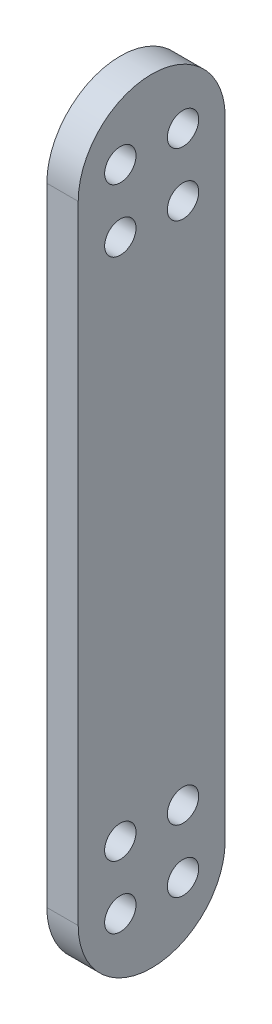
ISO-10303-21;
HEADER;
FILE_DESCRIPTION(('STEP AP214'),'2;1');
FILE_NAME('part.step','',(''),(''),'','','');
FILE_SCHEMA(('AUTOMOTIVE_DESIGN { 1 0 10303 214 1 1 1 1 }'));
ENDSEC;
DATA;
#1=APPLICATION_CONTEXT('core data for automotive mechanical design processes');
#2=APPLICATION_PROTOCOL_DEFINITION('international standard','automotive_design',2000,#1);
#3=PRODUCT_CONTEXT('',#1,'mechanical');
#4=PRODUCT('Part','Part','',(#3));
#5=PRODUCT_RELATED_PRODUCT_CATEGORY('part','',(#4));
#6=PRODUCT_DEFINITION_FORMATION('','',#4);
#7=PRODUCT_DEFINITION_CONTEXT('part definition',#1,'design');
#8=PRODUCT_DEFINITION('design','',#6,#7);
#9=PRODUCT_DEFINITION_SHAPE('','',#8);
#10=(LENGTH_UNIT() NAMED_UNIT(*) SI_UNIT(.MILLI.,.METRE.));
#11=(NAMED_UNIT(*) PLANE_ANGLE_UNIT() SI_UNIT($,.RADIAN.));
#12=(NAMED_UNIT(*) SI_UNIT($,.STERADIAN.) SOLID_ANGLE_UNIT());
#13=UNCERTAINTY_MEASURE_WITH_UNIT(LENGTH_MEASURE(1.E-05),#10,'distance_accuracy_value','');
#14=(GEOMETRIC_REPRESENTATION_CONTEXT(3) GLOBAL_UNCERTAINTY_ASSIGNED_CONTEXT((#13)) GLOBAL_UNIT_ASSIGNED_CONTEXT((#10,
#11,#12)) REPRESENTATION_CONTEXT('',''));
#15=CARTESIAN_POINT('',(0.,0.,0.));
#16=DIRECTION('',(0.,0.,1.));
#17=DIRECTION('',(1.,0.,0.));
#18=AXIS2_PLACEMENT_3D('',#15,#16,#17);
#19=CARTESIAN_POINT('',(0.,0.,0.));
#20=DIRECTION('',(-1.,0.,0.));
#21=DIRECTION('',(0.,0.,1.));
#22=AXIS2_PLACEMENT_3D('',#19,#20,#21);
#23=PLANE('',#22);
#24=CARTESIAN_POINT('',(0.,125.413224236194,25.));
#25=DIRECTION('',(-1.,0.,0.));
#26=DIRECTION('',(0.,0.,1.));
#27=AXIS2_PLACEMENT_3D('',#24,#25,#26);
#28=CIRCLE('',#27,2.5);
#29=CARTESIAN_POINT('',(0.,125.413224236194,27.5));
#30=VERTEX_POINT('',#29);
#31=EDGE_CURVE('E130',#30,#30,#28,.T.);
#32=ORIENTED_EDGE('',*,*,#31,.T.);
#33=EDGE_LOOP('',(#32));
#34=FACE_BOUND('',#33,.T.);
#35=CARTESIAN_POINT('',(0.,125.413224236194,15.));
#36=DIRECTION('',(-1.,0.,0.));
#37=DIRECTION('',(0.,0.,1.));
#38=AXIS2_PLACEMENT_3D('',#35,#36,#37);
#39=CIRCLE('',#38,2.5);
#40=CARTESIAN_POINT('',(0.,125.413224236194,17.5));
#41=VERTEX_POINT('',#40);
#42=EDGE_CURVE('E114',#41,#41,#39,.T.);
#43=ORIENTED_EDGE('',*,*,#42,.T.);
#44=EDGE_LOOP('',(#43));
#45=FACE_BOUND('',#44,.T.);
#46=CARTESIAN_POINT('',(0.,135.413224236194,25.));
#47=DIRECTION('',(-1.,0.,0.));
#48=DIRECTION('',(0.,0.,1.));
#49=AXIS2_PLACEMENT_3D('',#46,#47,#48);
#50=CIRCLE('',#49,2.5);
#51=CARTESIAN_POINT('',(0.,135.413224236194,27.5));
#52=VERTEX_POINT('',#51);
#53=EDGE_CURVE('E110',#52,#52,#50,.T.);
#54=ORIENTED_EDGE('',*,*,#53,.T.);
#55=EDGE_LOOP('',(#54));
#56=FACE_BOUND('',#55,.T.);
#57=CARTESIAN_POINT('',(0.,135.413224236194,15.));
#58=DIRECTION('',(-1.,0.,0.));
#59=DIRECTION('',(0.,0.,1.));
#60=AXIS2_PLACEMENT_3D('',#57,#58,#59);
#61=CIRCLE('',#60,2.5);
#62=CARTESIAN_POINT('',(0.,135.413224236194,17.5));
#63=VERTEX_POINT('',#62);
#64=EDGE_CURVE('E107',#63,#63,#61,.T.);
#65=ORIENTED_EDGE('',*,*,#64,.T.);
#66=EDGE_LOOP('',(#65));
#67=FACE_BOUND('',#66,.T.);
#68=CARTESIAN_POINT('',(0.,133.697961809387,20.));
#69=DIRECTION('',(-1.,0.,0.));
#70=DIRECTION('',(0.,0.,1.));
#71=AXIS2_PLACEMENT_3D('',#68,#69,#70);
#72=CIRCLE('',#71,11.715262426807);
#73=CARTESIAN_POINT('',(0.,133.697961809387,31.715262426807));
#74=VERTEX_POINT('',#73);
#75=CARTESIAN_POINT('',(0.,133.697961809387,8.28473757319303));
#76=VERTEX_POINT('',#75);
#77=EDGE_CURVE('E126',#74,#76,#72,.T.);
#78=ORIENTED_EDGE('',*,*,#77,.F.);
#79=DIRECTION('',(0.,-1.,0.));
#80=VECTOR('',#79,1.);
#81=CARTESIAN_POINT('',(0.,0.,31.715262426807));
#82=LINE('',#81,#80);
#83=CARTESIAN_POINT('',(0.,33.6979618093871,31.715262426807));
#84=VERTEX_POINT('',#83);
#85=EDGE_CURVE('E46',#74,#84,#82,.T.);
#86=ORIENTED_EDGE('',*,*,#85,.T.);
#87=CARTESIAN_POINT('',(0.,33.6979618093871,20.));
#88=DIRECTION('',(-1.,0.,0.));
#89=DIRECTION('',(0.,0.,1.));
#90=AXIS2_PLACEMENT_3D('',#87,#88,#89);
#91=CIRCLE('',#90,11.715262426807);
#92=CARTESIAN_POINT('',(0.,33.6979618093871,8.28473757319303));
#93=VERTEX_POINT('',#92);
#94=EDGE_CURVE('E75',#93,#84,#91,.T.);
#95=ORIENTED_EDGE('',*,*,#94,.F.);
#96=DIRECTION('',(0.,1.,0.));
#97=VECTOR('',#96,1.);
#98=CARTESIAN_POINT('',(0.,0.,8.28473757319303));
#99=LINE('',#98,#97);
#100=EDGE_CURVE('E120',#93,#76,#99,.T.);
#101=ORIENTED_EDGE('',*,*,#100,.T.);
#102=EDGE_LOOP('',(#78,#86,#95,#101));
#103=FACE_BOUND('',#102,.T.);
#104=CARTESIAN_POINT('',(0.,31.9826993825801,25.));
#105=DIRECTION('',(-1.,0.,0.));
#106=DIRECTION('',(0.,0.,1.));
#107=AXIS2_PLACEMENT_3D('',#104,#105,#106);
#108=CIRCLE('',#107,2.5);
#109=CARTESIAN_POINT('',(0.,31.9826993825801,27.5));
#110=VERTEX_POINT('',#109);
#111=EDGE_CURVE('E11',#110,#110,#108,.F.);
#112=ORIENTED_EDGE('',*,*,#111,.F.);
#113=EDGE_LOOP('',(#112));
#114=FACE_BOUND('',#113,.T.);
#115=CARTESIAN_POINT('',(0.,31.9826993825801,15.));
#116=DIRECTION('',(-1.,0.,0.));
#117=DIRECTION('',(0.,0.,1.));
#118=AXIS2_PLACEMENT_3D('',#115,#116,#117);
#119=CIRCLE('',#118,2.5);
#120=CARTESIAN_POINT('',(0.,31.9826993825801,17.5));
#121=VERTEX_POINT('',#120);
#122=EDGE_CURVE('E116',#121,#121,#119,.F.);
#123=ORIENTED_EDGE('',*,*,#122,.F.);
#124=EDGE_LOOP('',(#123));
#125=FACE_BOUND('',#124,.T.);
#126=CARTESIAN_POINT('',(0.,41.9826993825801,25.));
#127=DIRECTION('',(-1.,0.,0.));
#128=DIRECTION('',(0.,0.,1.));
#129=AXIS2_PLACEMENT_3D('',#126,#127,#128);
#130=CIRCLE('',#129,2.5);
#131=CARTESIAN_POINT('',(0.,41.9826993825801,27.5));
#132=VERTEX_POINT('',#131);
#133=EDGE_CURVE('E121',#132,#132,#130,.F.);
#134=ORIENTED_EDGE('',*,*,#133,.F.);
#135=EDGE_LOOP('',(#134));
#136=FACE_BOUND('',#135,.T.);
#137=CARTESIAN_POINT('',(0.,41.9826993825801,15.));
#138=DIRECTION('',(-1.,0.,0.));
#139=DIRECTION('',(0.,0.,1.));
#140=AXIS2_PLACEMENT_3D('',#137,#138,#139);
#141=CIRCLE('',#140,2.5);
#142=CARTESIAN_POINT('',(0.,41.9826993825801,17.5));
#143=VERTEX_POINT('',#142);
#144=EDGE_CURVE('E111',#143,#143,#141,.F.);
#145=ORIENTED_EDGE('',*,*,#144,.F.);
#146=EDGE_LOOP('',(#145));
#147=FACE_BOUND('',#146,.T.);
#148=ADVANCED_FACE('F36',(#34,#45,#56,#67,#103,#114,#125,#136,#147),#23,.F.);
#149=CARTESIAN_POINT('',(-5.,0.,8.28473757319303));
#150=DIRECTION('',(0.,0.,-1.));
#151=DIRECTION('',(-1.,0.,0.));
#152=AXIS2_PLACEMENT_3D('',#149,#150,#151);
#153=PLANE('',#152);
#154=ORIENTED_EDGE('',*,*,#100,.F.);
#155=DIRECTION('',(1.,0.,0.));
#156=VECTOR('',#155,1.);
#157=CARTESIAN_POINT('',(-5.,33.6979618093871,8.28473757319303));
#158=LINE('',#157,#156);
#159=CARTESIAN_POINT('',(-5.,33.6979618093871,8.28473757319303));
#160=VERTEX_POINT('',#159);
#161=EDGE_CURVE('E40',#160,#93,#158,.T.);
#162=ORIENTED_EDGE('',*,*,#161,.F.);
#163=DIRECTION('',(0.,1.,0.));
#164=VECTOR('',#163,1.);
#165=CARTESIAN_POINT('',(-5.,0.,8.28473757319303));
#166=LINE('',#165,#164);
#167=CARTESIAN_POINT('',(-5.,133.697961809387,8.28473757319303));
#168=VERTEX_POINT('',#167);
#169=EDGE_CURVE('E89',#160,#168,#166,.T.);
#170=ORIENTED_EDGE('',*,*,#169,.T.);
#171=DIRECTION('',(1.,0.,0.));
#172=VECTOR('',#171,1.);
#173=CARTESIAN_POINT('',(-5.,133.697961809387,8.28473757319303));
#174=LINE('',#173,#172);
#175=EDGE_CURVE('E106',#168,#76,#174,.T.);
#176=ORIENTED_EDGE('',*,*,#175,.T.);
#177=EDGE_LOOP('',(#154,#162,#170,#176));
#178=FACE_BOUND('',#177,.T.);
#179=ADVANCED_FACE('F144',(#178),#153,.T.);
#180=CARTESIAN_POINT('',(-5.,33.6979618093871,20.));
#181=DIRECTION('',(1.,0.,0.));
#182=DIRECTION('',(0.,0.,-1.));
#183=AXIS2_PLACEMENT_3D('',#180,#181,#182);
#184=CYLINDRICAL_SURFACE('',#183,11.715262426807);
#185=ORIENTED_EDGE('',*,*,#94,.T.);
#186=DIRECTION('',(1.,0.,0.));
#187=VECTOR('',#186,1.);
#188=CARTESIAN_POINT('',(-5.,33.6979618093871,31.715262426807));
#189=LINE('',#188,#187);
#190=CARTESIAN_POINT('',(-5.,33.6979618093871,31.715262426807));
#191=VERTEX_POINT('',#190);
#192=EDGE_CURVE('E92',#191,#84,#189,.T.);
#193=ORIENTED_EDGE('',*,*,#192,.F.);
#194=CARTESIAN_POINT('',(-5.,33.6979618093871,20.));
#195=DIRECTION('',(-1.,0.,0.));
#196=DIRECTION('',(0.,0.,1.));
#197=AXIS2_PLACEMENT_3D('',#194,#195,#196);
#198=CIRCLE('',#197,11.715262426807);
#199=EDGE_CURVE('E82',#160,#191,#198,.T.);
#200=ORIENTED_EDGE('',*,*,#199,.F.);
#201=ORIENTED_EDGE('',*,*,#161,.T.);
#202=EDGE_LOOP('',(#185,#193,#200,#201));
#203=FACE_BOUND('',#202,.T.);
#204=ADVANCED_FACE('F93',(#203),#184,.T.);
#205=CARTESIAN_POINT('',(-5.,0.,31.715262426807));
#206=DIRECTION('',(0.,0.,1.));
#207=DIRECTION('',(1.,0.,0.));
#208=AXIS2_PLACEMENT_3D('',#205,#206,#207);
#209=PLANE('',#208);
#210=ORIENTED_EDGE('',*,*,#85,.F.);
#211=DIRECTION('',(1.,0.,0.));
#212=VECTOR('',#211,1.);
#213=CARTESIAN_POINT('',(-5.,133.697961809387,31.715262426807));
#214=LINE('',#213,#212);
#215=CARTESIAN_POINT('',(-5.,133.697961809387,31.715262426807));
#216=VERTEX_POINT('',#215);
#217=EDGE_CURVE('E94',#216,#74,#214,.T.);
#218=ORIENTED_EDGE('',*,*,#217,.F.);
#219=DIRECTION('',(0.,-1.,0.));
#220=VECTOR('',#219,1.);
#221=CARTESIAN_POINT('',(-5.,0.,31.715262426807));
#222=LINE('',#221,#220);
#223=EDGE_CURVE('E87',#216,#191,#222,.T.);
#224=ORIENTED_EDGE('',*,*,#223,.T.);
#225=ORIENTED_EDGE('',*,*,#192,.T.);
#226=EDGE_LOOP('',(#210,#218,#224,#225));
#227=FACE_BOUND('',#226,.T.);
#228=ADVANCED_FACE('F95',(#227),#209,.T.);
#229=CARTESIAN_POINT('',(-5.,41.9826993825801,15.));
#230=DIRECTION('',(1.,0.,0.));
#231=DIRECTION('',(0.,0.,-1.));
#232=AXIS2_PLACEMENT_3D('',#229,#230,#231);
#233=CYLINDRICAL_SURFACE('',#232,2.5);
#234=CARTESIAN_POINT('',(-5.,41.9826993825801,15.));
#235=DIRECTION('',(-1.,0.,0.));
#236=DIRECTION('',(0.,0.,1.));
#237=AXIS2_PLACEMENT_3D('',#234,#235,#236);
#238=CIRCLE('',#237,2.5);
#239=CARTESIAN_POINT('',(-5.,41.9826993825801,17.5));
#240=VERTEX_POINT('',#239);
#241=EDGE_CURVE('E97',#240,#240,#238,.F.);
#242=ORIENTED_EDGE('',*,*,#241,.F.);
#243=EDGE_LOOP('',(#242));
#244=FACE_BOUND('',#243,.T.);
#245=ORIENTED_EDGE('',*,*,#144,.T.);
#246=EDGE_LOOP('',(#245));
#247=FACE_BOUND('',#246,.T.);
#248=ADVANCED_FACE('F193',(#244,#247),#233,.F.);
#249=CARTESIAN_POINT('',(-5.,133.697961809387,20.));
#250=DIRECTION('',(1.,0.,0.));
#251=DIRECTION('',(0.,0.,-1.));
#252=AXIS2_PLACEMENT_3D('',#249,#250,#251);
#253=CYLINDRICAL_SURFACE('',#252,11.715262426807);
#254=ORIENTED_EDGE('',*,*,#77,.T.);
#255=ORIENTED_EDGE('',*,*,#175,.F.);
#256=CARTESIAN_POINT('',(-5.,133.697961809387,20.));
#257=DIRECTION('',(-1.,0.,0.));
#258=DIRECTION('',(0.,0.,1.));
#259=AXIS2_PLACEMENT_3D('',#256,#257,#258);
#260=CIRCLE('',#259,11.715262426807);
#261=EDGE_CURVE('E55',#216,#168,#260,.T.);
#262=ORIENTED_EDGE('',*,*,#261,.F.);
#263=ORIENTED_EDGE('',*,*,#217,.T.);
#264=EDGE_LOOP('',(#254,#255,#262,#263));
#265=FACE_BOUND('',#264,.T.);
#266=ADVANCED_FACE('F140',(#265),#253,.T.);
#267=CARTESIAN_POINT('',(-5.,41.9826993825801,25.));
#268=DIRECTION('',(1.,0.,0.));
#269=DIRECTION('',(0.,0.,-1.));
#270=AXIS2_PLACEMENT_3D('',#267,#268,#269);
#271=CYLINDRICAL_SURFACE('',#270,2.5);
#272=CARTESIAN_POINT('',(-5.,41.9826993825801,25.));
#273=DIRECTION('',(-1.,0.,0.));
#274=DIRECTION('',(0.,0.,1.));
#275=AXIS2_PLACEMENT_3D('',#272,#273,#274);
#276=CIRCLE('',#275,2.5);
#277=CARTESIAN_POINT('',(-5.,41.9826993825801,27.5));
#278=VERTEX_POINT('',#277);
#279=EDGE_CURVE('E145',#278,#278,#276,.F.);
#280=ORIENTED_EDGE('',*,*,#279,.F.);
#281=EDGE_LOOP('',(#280));
#282=FACE_BOUND('',#281,.T.);
#283=ORIENTED_EDGE('',*,*,#133,.T.);
#284=EDGE_LOOP('',(#283));
#285=FACE_BOUND('',#284,.T.);
#286=ADVANCED_FACE('F180',(#282,#285),#271,.F.);
#287=CARTESIAN_POINT('',(-5.,31.9826993825801,15.));
#288=DIRECTION('',(1.,0.,0.));
#289=DIRECTION('',(0.,0.,-1.));
#290=AXIS2_PLACEMENT_3D('',#287,#288,#289);
#291=CYLINDRICAL_SURFACE('',#290,2.5);
#292=CARTESIAN_POINT('',(-5.,31.9826993825801,15.));
#293=DIRECTION('',(-1.,0.,0.));
#294=DIRECTION('',(0.,0.,1.));
#295=AXIS2_PLACEMENT_3D('',#292,#293,#294);
#296=CIRCLE('',#295,2.5);
#297=CARTESIAN_POINT('',(-5.,31.9826993825801,17.5));
#298=VERTEX_POINT('',#297);
#299=EDGE_CURVE('E147',#298,#298,#296,.F.);
#300=ORIENTED_EDGE('',*,*,#299,.F.);
#301=EDGE_LOOP('',(#300));
#302=FACE_BOUND('',#301,.T.);
#303=ORIENTED_EDGE('',*,*,#122,.T.);
#304=EDGE_LOOP('',(#303));
#305=FACE_BOUND('',#304,.T.);
#306=ADVANCED_FACE('F183',(#302,#305),#291,.F.);
#307=CARTESIAN_POINT('',(-5.,31.9826993825801,25.));
#308=DIRECTION('',(1.,0.,0.));
#309=DIRECTION('',(0.,0.,-1.));
#310=AXIS2_PLACEMENT_3D('',#307,#308,#309);
#311=CYLINDRICAL_SURFACE('',#310,2.5);
#312=CARTESIAN_POINT('',(-5.,31.9826993825801,25.));
#313=DIRECTION('',(-1.,0.,0.));
#314=DIRECTION('',(0.,0.,1.));
#315=AXIS2_PLACEMENT_3D('',#312,#313,#314);
#316=CIRCLE('',#315,2.5);
#317=CARTESIAN_POINT('',(-5.,31.9826993825801,27.5));
#318=VERTEX_POINT('',#317);
#319=EDGE_CURVE('E152',#318,#318,#316,.F.);
#320=ORIENTED_EDGE('',*,*,#319,.F.);
#321=EDGE_LOOP('',(#320));
#322=FACE_BOUND('',#321,.T.);
#323=ORIENTED_EDGE('',*,*,#111,.T.);
#324=EDGE_LOOP('',(#323));
#325=FACE_BOUND('',#324,.T.);
#326=ADVANCED_FACE('F212',(#322,#325),#311,.F.);
#327=CARTESIAN_POINT('',(-5.,125.413224236194,15.));
#328=DIRECTION('',(1.,0.,0.));
#329=DIRECTION('',(0.,0.,-1.));
#330=AXIS2_PLACEMENT_3D('',#327,#328,#329);
#331=CYLINDRICAL_SURFACE('',#330,2.5);
#332=CARTESIAN_POINT('',(-5.,125.413224236194,15.));
#333=DIRECTION('',(-1.,0.,0.));
#334=DIRECTION('',(0.,0.,1.));
#335=AXIS2_PLACEMENT_3D('',#332,#333,#334);
#336=CIRCLE('',#335,2.5);
#337=CARTESIAN_POINT('',(-5.,125.413224236194,17.5));
#338=VERTEX_POINT('',#337);
#339=EDGE_CURVE('E155',#338,#338,#336,.T.);
#340=ORIENTED_EDGE('',*,*,#339,.T.);
#341=EDGE_LOOP('',(#340));
#342=FACE_BOUND('',#341,.T.);
#343=ORIENTED_EDGE('',*,*,#42,.F.);
#344=EDGE_LOOP('',(#343));
#345=FACE_BOUND('',#344,.T.);
#346=ADVANCED_FACE('F216',(#342,#345),#331,.F.);
#347=CARTESIAN_POINT('',(-5.,135.413224236194,25.));
#348=DIRECTION('',(1.,0.,0.));
#349=DIRECTION('',(0.,0.,-1.));
#350=AXIS2_PLACEMENT_3D('',#347,#348,#349);
#351=CYLINDRICAL_SURFACE('',#350,2.5);
#352=CARTESIAN_POINT('',(-5.,135.413224236194,25.));
#353=DIRECTION('',(-1.,0.,0.));
#354=DIRECTION('',(0.,0.,1.));
#355=AXIS2_PLACEMENT_3D('',#352,#353,#354);
#356=CIRCLE('',#355,2.5);
#357=CARTESIAN_POINT('',(-5.,135.413224236194,27.5));
#358=VERTEX_POINT('',#357);
#359=EDGE_CURVE('E158',#358,#358,#356,.T.);
#360=ORIENTED_EDGE('',*,*,#359,.T.);
#361=EDGE_LOOP('',(#360));
#362=FACE_BOUND('',#361,.T.);
#363=ORIENTED_EDGE('',*,*,#53,.F.);
#364=EDGE_LOOP('',(#363));
#365=FACE_BOUND('',#364,.T.);
#366=ADVANCED_FACE('F219',(#362,#365),#351,.F.);
#367=CARTESIAN_POINT('',(-5.,135.413224236194,15.));
#368=DIRECTION('',(1.,0.,0.));
#369=DIRECTION('',(0.,0.,-1.));
#370=AXIS2_PLACEMENT_3D('',#367,#368,#369);
#371=CYLINDRICAL_SURFACE('',#370,2.5);
#372=CARTESIAN_POINT('',(-5.,135.413224236194,15.));
#373=DIRECTION('',(-1.,0.,0.));
#374=DIRECTION('',(0.,0.,1.));
#375=AXIS2_PLACEMENT_3D('',#372,#373,#374);
#376=CIRCLE('',#375,2.5);
#377=CARTESIAN_POINT('',(-5.,135.413224236194,17.5));
#378=VERTEX_POINT('',#377);
#379=EDGE_CURVE('E135',#378,#378,#376,.T.);
#380=ORIENTED_EDGE('',*,*,#379,.T.);
#381=EDGE_LOOP('',(#380));
#382=FACE_BOUND('',#381,.T.);
#383=ORIENTED_EDGE('',*,*,#64,.F.);
#384=EDGE_LOOP('',(#383));
#385=FACE_BOUND('',#384,.T.);
#386=ADVANCED_FACE('F38',(#382,#385),#371,.F.);
#387=CARTESIAN_POINT('',(-5.,125.413224236194,25.));
#388=DIRECTION('',(1.,0.,0.));
#389=DIRECTION('',(0.,0.,-1.));
#390=AXIS2_PLACEMENT_3D('',#387,#388,#389);
#391=CYLINDRICAL_SURFACE('',#390,2.5);
#392=CARTESIAN_POINT('',(-5.,125.413224236194,25.));
#393=DIRECTION('',(-1.,0.,0.));
#394=DIRECTION('',(0.,0.,1.));
#395=AXIS2_PLACEMENT_3D('',#392,#393,#394);
#396=CIRCLE('',#395,2.5);
#397=CARTESIAN_POINT('',(-5.,125.413224236194,27.5));
#398=VERTEX_POINT('',#397);
#399=EDGE_CURVE('E103',#398,#398,#396,.T.);
#400=ORIENTED_EDGE('',*,*,#399,.T.);
#401=EDGE_LOOP('',(#400));
#402=FACE_BOUND('',#401,.T.);
#403=ORIENTED_EDGE('',*,*,#31,.F.);
#404=EDGE_LOOP('',(#403));
#405=FACE_BOUND('',#404,.T.);
#406=ADVANCED_FACE('F168',(#402,#405),#391,.F.);
#407=CARTESIAN_POINT('',(-5.,0.,0.));
#408=DIRECTION('',(-1.,0.,0.));
#409=DIRECTION('',(0.,0.,1.));
#410=AXIS2_PLACEMENT_3D('',#407,#408,#409);
#411=PLANE('',#410);
#412=ORIENTED_EDGE('',*,*,#379,.F.);
#413=EDGE_LOOP('',(#412));
#414=FACE_BOUND('',#413,.T.);
#415=ORIENTED_EDGE('',*,*,#359,.F.);
#416=EDGE_LOOP('',(#415));
#417=FACE_BOUND('',#416,.T.);
#418=ORIENTED_EDGE('',*,*,#339,.F.);
#419=EDGE_LOOP('',(#418));
#420=FACE_BOUND('',#419,.T.);
#421=ORIENTED_EDGE('',*,*,#319,.T.);
#422=EDGE_LOOP('',(#421));
#423=FACE_BOUND('',#422,.T.);
#424=ORIENTED_EDGE('',*,*,#299,.T.);
#425=EDGE_LOOP('',(#424));
#426=FACE_BOUND('',#425,.T.);
#427=ORIENTED_EDGE('',*,*,#279,.T.);
#428=EDGE_LOOP('',(#427));
#429=FACE_BOUND('',#428,.T.);
#430=ORIENTED_EDGE('',*,*,#169,.F.);
#431=ORIENTED_EDGE('',*,*,#199,.T.);
#432=ORIENTED_EDGE('',*,*,#223,.F.);
#433=ORIENTED_EDGE('',*,*,#261,.T.);
#434=EDGE_LOOP('',(#430,#431,#432,#433));
#435=FACE_BOUND('',#434,.T.);
#436=ORIENTED_EDGE('',*,*,#241,.T.);
#437=EDGE_LOOP('',(#436));
#438=FACE_BOUND('',#437,.T.);
#439=ORIENTED_EDGE('',*,*,#399,.F.);
#440=EDGE_LOOP('',(#439));
#441=FACE_BOUND('',#440,.T.);
#442=ADVANCED_FACE('F84',(#414,#417,#420,#423,#426,#429,#435,#438,#441),#411,.T.);
#443=CLOSED_SHELL('',(#148,#179,#204,#228,#248,#266,#286,#306,#326,#346,#366,#386,#406,#442));
#444=MANIFOLD_SOLID_BREP('B2',#443);
#445=ADVANCED_BREP_SHAPE_REPRESENTATION('',(#18,#444),#14);
#446=SHAPE_DEFINITION_REPRESENTATION(#9,#445);
ENDSEC;
END-ISO-10303-21;
